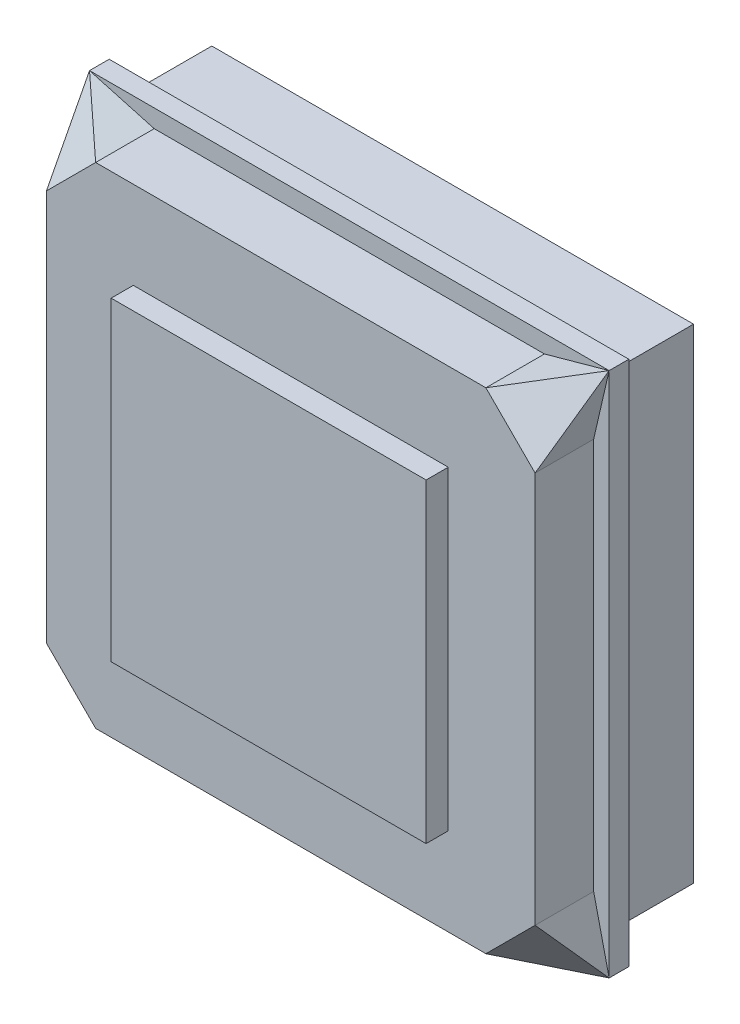
ISO-10303-21;
HEADER;
FILE_DESCRIPTION(('STEP AP214'),'2;1');
FILE_NAME('part.step','',(''),(''),'','','');
FILE_SCHEMA(('AUTOMOTIVE_DESIGN { 1 0 10303 214 1 1 1 1 }'));
ENDSEC;
DATA;
#1=APPLICATION_CONTEXT('core data for automotive mechanical design processes');
#2=APPLICATION_PROTOCOL_DEFINITION('international standard','automotive_design',2000,#1);
#3=PRODUCT_CONTEXT('',#1,'mechanical');
#4=PRODUCT('Part','Part','',(#3));
#5=PRODUCT_RELATED_PRODUCT_CATEGORY('part','',(#4));
#6=PRODUCT_DEFINITION_FORMATION('','',#4);
#7=PRODUCT_DEFINITION_CONTEXT('part definition',#1,'design');
#8=PRODUCT_DEFINITION('design','',#6,#7);
#9=PRODUCT_DEFINITION_SHAPE('','',#8);
#10=(LENGTH_UNIT() NAMED_UNIT(*) SI_UNIT(.MILLI.,.METRE.));
#11=(NAMED_UNIT(*) PLANE_ANGLE_UNIT() SI_UNIT($,.RADIAN.));
#12=(NAMED_UNIT(*) SI_UNIT($,.STERADIAN.) SOLID_ANGLE_UNIT());
#13=UNCERTAINTY_MEASURE_WITH_UNIT(LENGTH_MEASURE(1.E-05),#10,'distance_accuracy_value','');
#14=(GEOMETRIC_REPRESENTATION_CONTEXT(3) GLOBAL_UNCERTAINTY_ASSIGNED_CONTEXT((#13)) GLOBAL_UNIT_ASSIGNED_CONTEXT((#10,
#11,#12)) REPRESENTATION_CONTEXT('',''));
#15=CARTESIAN_POINT('',(0.,0.,0.));
#16=DIRECTION('',(0.,0.,1.));
#17=DIRECTION('',(1.,0.,0.));
#18=AXIS2_PLACEMENT_3D('',#15,#16,#17);
#19=CARTESIAN_POINT('',(0.,0.,4.0386));
#20=DIRECTION('',(0.,0.,-1.));
#21=DIRECTION('',(-1.,0.,0.));
#22=AXIS2_PLACEMENT_3D('',#19,#20,#21);
#23=PLANE('',#22);
#24=DIRECTION('',(0.,-1.,0.));
#25=VECTOR('',#24,1.);
#26=CARTESIAN_POINT('',(-12.6111,-10.1092,4.0386));
#27=LINE('',#26,#25);
#28=CARTESIAN_POINT('',(-12.6111,10.1092,4.0386));
#29=VERTEX_POINT('',#28);
#30=CARTESIAN_POINT('',(-12.6111,-10.1092,4.0386));
#31=VERTEX_POINT('',#30);
#32=EDGE_CURVE('E289',#29,#31,#27,.T.);
#33=ORIENTED_EDGE('',*,*,#32,.T.);
#34=DIRECTION('',(0.707106781186548,-0.707106781186548,0.));
#35=VECTOR('',#34,1.);
#36=CARTESIAN_POINT('',(-12.6111,-10.1092,4.0386));
#37=LINE('',#36,#35);
#38=CARTESIAN_POINT('',(-10.0711,-12.6492,4.0386));
#39=VERTEX_POINT('',#38);
#40=EDGE_CURVE('E291',#31,#39,#37,.T.);
#41=ORIENTED_EDGE('',*,*,#40,.T.);
#42=DIRECTION('',(1.,0.,0.));
#43=VECTOR('',#42,1.);
#44=CARTESIAN_POINT('',(-10.0711,-12.6492,4.0386));
#45=LINE('',#44,#43);
#46=CARTESIAN_POINT('',(10.0711,-12.6492,4.0386));
#47=VERTEX_POINT('',#46);
#48=EDGE_CURVE('E294',#39,#47,#45,.T.);
#49=ORIENTED_EDGE('',*,*,#48,.T.);
#50=DIRECTION('',(0.707106781186548,0.707106781186547,0.));
#51=VECTOR('',#50,1.);
#52=CARTESIAN_POINT('',(10.0711,-12.6492,4.0386));
#53=LINE('',#52,#51);
#54=CARTESIAN_POINT('',(12.6111,-10.1092,4.0386));
#55=VERTEX_POINT('',#54);
#56=EDGE_CURVE('E296',#47,#55,#53,.T.);
#57=ORIENTED_EDGE('',*,*,#56,.T.);
#58=DIRECTION('',(0.,1.,0.));
#59=VECTOR('',#58,1.);
#60=CARTESIAN_POINT('',(12.6111,-10.1092,4.0386));
#61=LINE('',#60,#59);
#62=CARTESIAN_POINT('',(12.6111,10.1092,4.0386));
#63=VERTEX_POINT('',#62);
#64=EDGE_CURVE('E298',#55,#63,#61,.T.);
#65=ORIENTED_EDGE('',*,*,#64,.T.);
#66=DIRECTION('',(-0.707106781186548,0.707106781186547,0.));
#67=VECTOR('',#66,1.);
#68=CARTESIAN_POINT('',(10.0711,12.6492,4.0386));
#69=LINE('',#68,#67);
#70=CARTESIAN_POINT('',(10.0711,12.6492,4.0386));
#71=VERTEX_POINT('',#70);
#72=EDGE_CURVE('E300',#63,#71,#69,.T.);
#73=ORIENTED_EDGE('',*,*,#72,.T.);
#74=DIRECTION('',(-1.,0.,0.));
#75=VECTOR('',#74,1.);
#76=CARTESIAN_POINT('',(-10.0711,12.6492,4.0386));
#77=LINE('',#76,#75);
#78=CARTESIAN_POINT('',(-10.0711,12.6492,4.0386));
#79=VERTEX_POINT('',#78);
#80=EDGE_CURVE('E302',#71,#79,#77,.T.);
#81=ORIENTED_EDGE('',*,*,#80,.T.);
#82=DIRECTION('',(-0.707106781186548,-0.707106781186548,0.));
#83=VECTOR('',#82,1.);
#84=CARTESIAN_POINT('',(-12.6111,10.1092,4.0386));
#85=LINE('',#84,#83);
#86=EDGE_CURVE('E304',#79,#29,#85,.T.);
#87=ORIENTED_EDGE('',*,*,#86,.T.);
#88=EDGE_LOOP('',(#33,#41,#49,#57,#65,#73,#81,#87));
#89=FACE_BOUND('',#88,.T.);
#90=DIRECTION('',(0.,1.,0.));
#91=VECTOR('',#90,1.);
#92=CARTESIAN_POINT('',(8.128,-8.128,4.0386));
#93=LINE('',#92,#91);
#94=CARTESIAN_POINT('',(8.128,-8.128,4.0386));
#95=VERTEX_POINT('',#94);
#96=CARTESIAN_POINT('',(8.128,8.128,4.0386));
#97=VERTEX_POINT('',#96);
#98=EDGE_CURVE('E207',#95,#97,#93,.T.);
#99=ORIENTED_EDGE('',*,*,#98,.F.);
#100=DIRECTION('',(1.,0.,0.));
#101=VECTOR('',#100,1.);
#102=CARTESIAN_POINT('',(-8.128,-8.128,4.0386));
#103=LINE('',#102,#101);
#104=CARTESIAN_POINT('',(-8.128,-8.128,4.0386));
#105=VERTEX_POINT('',#104);
#106=EDGE_CURVE('E204',#105,#95,#103,.T.);
#107=ORIENTED_EDGE('',*,*,#106,.F.);
#108=DIRECTION('',(0.,-1.,0.));
#109=VECTOR('',#108,1.);
#110=CARTESIAN_POINT('',(-8.128,-8.128,4.0386));
#111=LINE('',#110,#109);
#112=CARTESIAN_POINT('',(-8.128,8.128,4.0386));
#113=VERTEX_POINT('',#112);
#114=EDGE_CURVE('E70',#113,#105,#111,.T.);
#115=ORIENTED_EDGE('',*,*,#114,.F.);
#116=DIRECTION('',(-1.,0.,0.));
#117=VECTOR('',#116,1.);
#118=CARTESIAN_POINT('',(-8.128,8.128,4.0386));
#119=LINE('',#118,#117);
#120=EDGE_CURVE('E65',#97,#113,#119,.T.);
#121=ORIENTED_EDGE('',*,*,#120,.F.);
#122=EDGE_LOOP('',(#99,#107,#115,#121));
#123=FACE_BOUND('',#122,.T.);
#124=ADVANCED_FACE('F50',(#89,#123),#23,.F.);
#125=CARTESIAN_POINT('',(0.,0.,1.016));
#126=DIRECTION('',(0.,0.,-1.));
#127=DIRECTION('',(-1.,0.,0.));
#128=AXIS2_PLACEMENT_3D('',#125,#126,#127);
#129=PLANE('',#128);
#130=DIRECTION('',(0.963570380580632,-0.267454896510976,0.));
#131=VECTOR('',#130,1.);
#132=CARTESIAN_POINT('',(10.0711,-12.6492,1.016));
#133=LINE('',#132,#131);
#134=CARTESIAN_POINT('',(10.0711,-12.6492,1.016));
#135=VERTEX_POINT('',#134);
#136=CARTESIAN_POINT('',(13.4112,-13.5763,1.016));
#137=VERTEX_POINT('',#136);
#138=EDGE_CURVE('E217',#135,#137,#133,.T.);
#139=ORIENTED_EDGE('',*,*,#138,.F.);
#140=DIRECTION('',(1.,0.,0.));
#141=VECTOR('',#140,1.);
#142=CARTESIAN_POINT('',(-10.0711,-12.6492,1.016));
#143=LINE('',#142,#141);
#144=CARTESIAN_POINT('',(-10.0711,-12.6492,1.016));
#145=VERTEX_POINT('',#144);
#146=EDGE_CURVE('E309',#145,#135,#143,.T.);
#147=ORIENTED_EDGE('',*,*,#146,.F.);
#148=DIRECTION('',(0.963570380580632,0.267454896510975,0.));
#149=VECTOR('',#148,1.);
#150=CARTESIAN_POINT('',(-13.4112,-13.5763,1.016));
#151=LINE('',#150,#149);
#152=CARTESIAN_POINT('',(-13.4112,-13.5763,1.016));
#153=VERTEX_POINT('',#152);
#154=EDGE_CURVE('E220',#153,#145,#151,.T.);
#155=ORIENTED_EDGE('',*,*,#154,.F.);
#156=DIRECTION('',(1.,0.,0.));
#157=VECTOR('',#156,1.);
#158=CARTESIAN_POINT('',(-13.4112,-13.5763,1.016));
#159=LINE('',#158,#157);
#160=EDGE_CURVE('E349',#153,#137,#159,.T.);
#161=ORIENTED_EDGE('',*,*,#160,.T.);
#162=EDGE_LOOP('',(#139,#147,#155,#161));
#163=FACE_BOUND('',#162,.T.);
#164=ADVANCED_FACE('F427',(#163),#129,.F.);
#165=DIRECTION('',(0.,1.,0.));
#166=VECTOR('',#165,1.);
#167=CARTESIAN_POINT('',(12.6111,-10.1092,1.016));
#168=LINE('',#167,#166);
#169=CARTESIAN_POINT('',(12.6111,-10.1092,1.016));
#170=VERTEX_POINT('',#169);
#171=CARTESIAN_POINT('',(12.6111,10.1092,1.016));
#172=VERTEX_POINT('',#171);
#173=EDGE_CURVE('E312',#170,#172,#168,.T.);
#174=ORIENTED_EDGE('',*,*,#173,.F.);
#175=DIRECTION('',(0.224859506698758,-0.97439119569462,0.));
#176=VECTOR('',#175,1.);
#177=CARTESIAN_POINT('',(12.6111,-10.1092,1.016));
#178=LINE('',#177,#176);
#179=EDGE_CURVE('E221',#170,#137,#178,.T.);
#180=ORIENTED_EDGE('',*,*,#179,.T.);
#181=DIRECTION('',(0.,1.,0.));
#182=VECTOR('',#181,1.);
#183=CARTESIAN_POINT('',(13.4112,-13.5763,1.016));
#184=LINE('',#183,#182);
#185=CARTESIAN_POINT('',(13.4112,13.5763,1.016));
#186=VERTEX_POINT('',#185);
#187=EDGE_CURVE('E339',#137,#186,#184,.T.);
#188=ORIENTED_EDGE('',*,*,#187,.T.);
#189=DIRECTION('',(0.224859506698758,0.97439119569462,0.));
#190=VECTOR('',#189,1.);
#191=CARTESIAN_POINT('',(12.6111,10.1092,1.016));
#192=LINE('',#191,#190);
#193=EDGE_CURVE('E248',#172,#186,#192,.T.);
#194=ORIENTED_EDGE('',*,*,#193,.F.);
#195=EDGE_LOOP('',(#174,#180,#188,#194));
#196=FACE_BOUND('',#195,.T.);
#197=ADVANCED_FACE('F385',(#196),#129,.F.);
#198=DIRECTION('',(0.,-1.,0.));
#199=VECTOR('',#198,1.);
#200=CARTESIAN_POINT('',(-13.4112,-13.5763,1.016));
#201=LINE('',#200,#199);
#202=CARTESIAN_POINT('',(-13.4112,13.5763,1.016));
#203=VERTEX_POINT('',#202);
#204=EDGE_CURVE('E346',#203,#153,#201,.T.);
#205=ORIENTED_EDGE('',*,*,#204,.T.);
#206=DIRECTION('',(0.224859506698758,0.97439119569462,0.));
#207=VECTOR('',#206,1.);
#208=CARTESIAN_POINT('',(-13.4112,-13.5763,1.016));
#209=LINE('',#208,#207);
#210=CARTESIAN_POINT('',(-12.6111,-10.1092,1.016));
#211=VERTEX_POINT('',#210);
#212=EDGE_CURVE('E226',#153,#211,#209,.T.);
#213=ORIENTED_EDGE('',*,*,#212,.T.);
#214=DIRECTION('',(0.,-1.,0.));
#215=VECTOR('',#214,1.);
#216=CARTESIAN_POINT('',(-12.6111,-10.1092,1.016));
#217=LINE('',#216,#215);
#218=CARTESIAN_POINT('',(-12.6111,10.1092,1.016));
#219=VERTEX_POINT('',#218);
#220=EDGE_CURVE('E288',#219,#211,#217,.T.);
#221=ORIENTED_EDGE('',*,*,#220,.F.);
#222=DIRECTION('',(0.224859506698759,-0.97439119569462,0.));
#223=VECTOR('',#222,1.);
#224=CARTESIAN_POINT('',(-13.4112,13.5763,1.016));
#225=LINE('',#224,#223);
#226=EDGE_CURVE('E228',#203,#219,#225,.T.);
#227=ORIENTED_EDGE('',*,*,#226,.F.);
#228=EDGE_LOOP('',(#205,#213,#221,#227));
#229=FACE_BOUND('',#228,.T.);
#230=ADVANCED_FACE('F453',(#229),#129,.F.);
#231=CARTESIAN_POINT('',(0.,0.,0.));
#232=DIRECTION('',(0.,0.,-1.));
#233=DIRECTION('',(-1.,0.,0.));
#234=AXIS2_PLACEMENT_3D('',#231,#232,#233);
#235=PLANE('',#234);
#236=DIRECTION('',(0.,1.,0.));
#237=VECTOR('',#236,1.);
#238=CARTESIAN_POINT('',(13.4112,-13.5763,0.));
#239=LINE('',#238,#237);
#240=CARTESIAN_POINT('',(13.4112,-13.5763,0.));
#241=VERTEX_POINT('',#240);
#242=CARTESIAN_POINT('',(13.4112,13.5763,0.));
#243=VERTEX_POINT('',#242);
#244=EDGE_CURVE('E338',#241,#243,#239,.T.);
#245=ORIENTED_EDGE('',*,*,#244,.F.);
#246=DIRECTION('',(1.,0.,0.));
#247=VECTOR('',#246,1.);
#248=CARTESIAN_POINT('',(-13.4112,-13.5763,0.));
#249=LINE('',#248,#247);
#250=CARTESIAN_POINT('',(-13.4112,-13.5763,0.));
#251=VERTEX_POINT('',#250);
#252=EDGE_CURVE('E343',#251,#241,#249,.T.);
#253=ORIENTED_EDGE('',*,*,#252,.F.);
#254=DIRECTION('',(0.,-1.,0.));
#255=VECTOR('',#254,1.);
#256=CARTESIAN_POINT('',(-13.4112,-13.5763,0.));
#257=LINE('',#256,#255);
#258=CARTESIAN_POINT('',(-13.4112,13.5763,0.));
#259=VERTEX_POINT('',#258);
#260=EDGE_CURVE('E357',#259,#251,#257,.T.);
#261=ORIENTED_EDGE('',*,*,#260,.F.);
#262=DIRECTION('',(-1.,0.,0.));
#263=VECTOR('',#262,1.);
#264=CARTESIAN_POINT('',(-13.4112,13.5763,0.));
#265=LINE('',#264,#263);
#266=EDGE_CURVE('E355',#243,#259,#265,.T.);
#267=ORIENTED_EDGE('',*,*,#266,.F.);
#268=EDGE_LOOP('',(#245,#253,#261,#267));
#269=FACE_BOUND('',#268,.T.);
#270=DIRECTION('',(1.,0.,0.));
#271=VECTOR('',#270,1.);
#272=CARTESIAN_POINT('',(12.4333,12.4968,0.));
#273=LINE('',#272,#271);
#274=CARTESIAN_POINT('',(-12.4333,12.4968,0.));
#275=VERTEX_POINT('',#274);
#276=CARTESIAN_POINT('',(12.4333,12.4968,0.));
#277=VERTEX_POINT('',#276);
#278=EDGE_CURVE('E273',#275,#277,#273,.T.);
#279=ORIENTED_EDGE('',*,*,#278,.F.);
#280=DIRECTION('',(0.,1.,0.));
#281=VECTOR('',#280,1.);
#282=CARTESIAN_POINT('',(-12.4333,-12.4968,0.));
#283=LINE('',#282,#281);
#284=CARTESIAN_POINT('',(-12.4333,-12.4968,0.));
#285=VERTEX_POINT('',#284);
#286=EDGE_CURVE('E251',#285,#275,#283,.T.);
#287=ORIENTED_EDGE('',*,*,#286,.F.);
#288=DIRECTION('',(-1.,0.,0.));
#289=VECTOR('',#288,1.);
#290=CARTESIAN_POINT('',(12.4333,-12.4968,0.));
#291=LINE('',#290,#289);
#292=CARTESIAN_POINT('',(12.4333,-12.4968,0.));
#293=VERTEX_POINT('',#292);
#294=EDGE_CURVE('E264',#293,#285,#291,.T.);
#295=ORIENTED_EDGE('',*,*,#294,.F.);
#296=DIRECTION('',(0.,-1.,0.));
#297=VECTOR('',#296,1.);
#298=CARTESIAN_POINT('',(12.4333,-12.4968,0.));
#299=LINE('',#298,#297);
#300=EDGE_CURVE('E275',#277,#293,#299,.T.);
#301=ORIENTED_EDGE('',*,*,#300,.F.);
#302=EDGE_LOOP('',(#279,#287,#295,#301));
#303=FACE_BOUND('',#302,.T.);
#304=ADVANCED_FACE('F377',(#269,#303),#235,.T.);
#305=DIRECTION('',(-1.,0.,0.));
#306=VECTOR('',#305,1.);
#307=CARTESIAN_POINT('',(-13.4112,13.5763,1.016));
#308=LINE('',#307,#306);
#309=EDGE_CURVE('E342',#186,#203,#308,.T.);
#310=ORIENTED_EDGE('',*,*,#309,.T.);
#311=DIRECTION('',(0.963570380580632,-0.267454896510973,0.));
#312=VECTOR('',#311,1.);
#313=CARTESIAN_POINT('',(-13.4112,13.5763,1.016));
#314=LINE('',#313,#312);
#315=CARTESIAN_POINT('',(-10.0711,12.6492,1.016));
#316=VERTEX_POINT('',#315);
#317=EDGE_CURVE('E237',#203,#316,#314,.T.);
#318=ORIENTED_EDGE('',*,*,#317,.T.);
#319=DIRECTION('',(-1.,0.,0.));
#320=VECTOR('',#319,1.);
#321=CARTESIAN_POINT('',(-10.0711,12.6492,1.016));
#322=LINE('',#321,#320);
#323=CARTESIAN_POINT('',(10.0711,12.6492,1.016));
#324=VERTEX_POINT('',#323);
#325=EDGE_CURVE('E292',#324,#316,#322,.T.);
#326=ORIENTED_EDGE('',*,*,#325,.F.);
#327=DIRECTION('',(0.963570380580633,0.267454896510973,0.));
#328=VECTOR('',#327,1.);
#329=CARTESIAN_POINT('',(10.0711,12.6492,1.016));
#330=LINE('',#329,#328);
#331=EDGE_CURVE('E252',#324,#186,#330,.T.);
#332=ORIENTED_EDGE('',*,*,#331,.T.);
#333=EDGE_LOOP('',(#310,#318,#326,#332));
#334=FACE_BOUND('',#333,.T.);
#335=ADVANCED_FACE('F390',(#334),#129,.F.);
#336=CARTESIAN_POINT('',(13.4112,-13.5763,1.016));
#337=DIRECTION('',(-1.,0.,0.));
#338=DIRECTION('',(0.,0.,1.));
#339=AXIS2_PLACEMENT_3D('',#336,#337,#338);
#340=PLANE('',#339);
#341=ORIENTED_EDGE('',*,*,#244,.T.);
#342=DIRECTION('',(0.,0.,-1.));
#343=VECTOR('',#342,1.);
#344=CARTESIAN_POINT('',(13.4112,13.5763,1.016));
#345=LINE('',#344,#343);
#346=EDGE_CURVE('E12',#186,#243,#345,.T.);
#347=ORIENTED_EDGE('',*,*,#346,.F.);
#348=ORIENTED_EDGE('',*,*,#187,.F.);
#349=DIRECTION('',(0.,0.,-1.));
#350=VECTOR('',#349,1.);
#351=CARTESIAN_POINT('',(13.4112,-13.5763,1.016));
#352=LINE('',#351,#350);
#353=EDGE_CURVE('E352',#137,#241,#352,.T.);
#354=ORIENTED_EDGE('',*,*,#353,.T.);
#355=EDGE_LOOP('',(#341,#347,#348,#354));
#356=FACE_BOUND('',#355,.T.);
#357=ADVANCED_FACE('F52',(#356),#340,.F.);
#358=CARTESIAN_POINT('',(-13.4112,13.5763,1.016));
#359=DIRECTION('',(0.,-1.,0.));
#360=DIRECTION('',(0.,0.,-1.));
#361=AXIS2_PLACEMENT_3D('',#358,#359,#360);
#362=PLANE('',#361);
#363=ORIENTED_EDGE('',*,*,#266,.T.);
#364=DIRECTION('',(0.,0.,-1.));
#365=VECTOR('',#364,1.);
#366=CARTESIAN_POINT('',(-13.4112,13.5763,1.016));
#367=LINE('',#366,#365);
#368=EDGE_CURVE('E58',#203,#259,#367,.T.);
#369=ORIENTED_EDGE('',*,*,#368,.F.);
#370=ORIENTED_EDGE('',*,*,#309,.F.);
#371=ORIENTED_EDGE('',*,*,#346,.T.);
#372=EDGE_LOOP('',(#363,#369,#370,#371));
#373=FACE_BOUND('',#372,.T.);
#374=ADVANCED_FACE('F387',(#373),#362,.F.);
#375=CARTESIAN_POINT('',(-13.4112,-13.5763,1.016));
#376=DIRECTION('',(1.,0.,0.));
#377=DIRECTION('',(0.,0.,-1.));
#378=AXIS2_PLACEMENT_3D('',#375,#376,#377);
#379=PLANE('',#378);
#380=ORIENTED_EDGE('',*,*,#260,.T.);
#381=DIRECTION('',(0.,0.,-1.));
#382=VECTOR('',#381,1.);
#383=CARTESIAN_POINT('',(-13.4112,-13.5763,1.016));
#384=LINE('',#383,#382);
#385=EDGE_CURVE('E362',#153,#251,#384,.T.);
#386=ORIENTED_EDGE('',*,*,#385,.F.);
#387=ORIENTED_EDGE('',*,*,#204,.F.);
#388=ORIENTED_EDGE('',*,*,#368,.T.);
#389=EDGE_LOOP('',(#380,#386,#387,#388));
#390=FACE_BOUND('',#389,.T.);
#391=ADVANCED_FACE('F369',(#390),#379,.F.);
#392=CARTESIAN_POINT('',(-13.4112,-13.5763,1.016));
#393=DIRECTION('',(0.,1.,0.));
#394=DIRECTION('',(0.,0.,1.));
#395=AXIS2_PLACEMENT_3D('',#392,#393,#394);
#396=PLANE('',#395);
#397=ORIENTED_EDGE('',*,*,#252,.T.);
#398=ORIENTED_EDGE('',*,*,#353,.F.);
#399=ORIENTED_EDGE('',*,*,#160,.F.);
#400=ORIENTED_EDGE('',*,*,#385,.T.);
#401=EDGE_LOOP('',(#397,#398,#399,#400));
#402=FACE_BOUND('',#401,.T.);
#403=ADVANCED_FACE('F381',(#402),#396,.F.);
#404=CARTESIAN_POINT('',(-12.6111,-10.1092,4.0386));
#405=DIRECTION('',(1.,0.,0.));
#406=DIRECTION('',(0.,0.,-1.));
#407=AXIS2_PLACEMENT_3D('',#404,#405,#406);
#408=PLANE('',#407);
#409=ORIENTED_EDGE('',*,*,#220,.T.);
#410=DIRECTION('',(0.,0.,-1.));
#411=VECTOR('',#410,1.);
#412=CARTESIAN_POINT('',(-12.6111,-10.1092,4.0386));
#413=LINE('',#412,#411);
#414=EDGE_CURVE('E335',#31,#211,#413,.T.);
#415=ORIENTED_EDGE('',*,*,#414,.F.);
#416=ORIENTED_EDGE('',*,*,#32,.F.);
#417=DIRECTION('',(0.,0.,-1.));
#418=VECTOR('',#417,1.);
#419=CARTESIAN_POINT('',(-12.6111,10.1092,4.0386));
#420=LINE('',#419,#418);
#421=EDGE_CURVE('E306',#29,#219,#420,.T.);
#422=ORIENTED_EDGE('',*,*,#421,.T.);
#423=EDGE_LOOP('',(#409,#415,#416,#422));
#424=FACE_BOUND('',#423,.T.);
#425=ADVANCED_FACE('F447',(#424),#408,.F.);
#426=CARTESIAN_POINT('',(-10.0711,-12.6492,4.0386));
#427=DIRECTION('',(0.,1.,0.));
#428=DIRECTION('',(0.,0.,1.));
#429=AXIS2_PLACEMENT_3D('',#426,#427,#428);
#430=PLANE('',#429);
#431=ORIENTED_EDGE('',*,*,#146,.T.);
#432=DIRECTION('',(0.,0.,-1.));
#433=VECTOR('',#432,1.);
#434=CARTESIAN_POINT('',(10.0711,-12.6492,4.0386));
#435=LINE('',#434,#433);
#436=EDGE_CURVE('E330',#47,#135,#435,.T.);
#437=ORIENTED_EDGE('',*,*,#436,.F.);
#438=ORIENTED_EDGE('',*,*,#48,.F.);
#439=DIRECTION('',(0.,0.,-1.));
#440=VECTOR('',#439,1.);
#441=CARTESIAN_POINT('',(-10.0711,-12.6492,4.0386));
#442=LINE('',#441,#440);
#443=EDGE_CURVE('E333',#39,#145,#442,.T.);
#444=ORIENTED_EDGE('',*,*,#443,.T.);
#445=EDGE_LOOP('',(#431,#437,#438,#444));
#446=FACE_BOUND('',#445,.T.);
#447=ADVANCED_FACE('F443',(#446),#430,.F.);
#448=CARTESIAN_POINT('',(12.6111,-10.1092,4.0386));
#449=DIRECTION('',(-1.,0.,0.));
#450=DIRECTION('',(0.,0.,1.));
#451=AXIS2_PLACEMENT_3D('',#448,#449,#450);
#452=PLANE('',#451);
#453=ORIENTED_EDGE('',*,*,#173,.T.);
#454=DIRECTION('',(0.,0.,-1.));
#455=VECTOR('',#454,1.);
#456=CARTESIAN_POINT('',(12.6111,10.1092,4.0386));
#457=LINE('',#456,#455);
#458=EDGE_CURVE('E324',#63,#172,#457,.T.);
#459=ORIENTED_EDGE('',*,*,#458,.F.);
#460=ORIENTED_EDGE('',*,*,#64,.F.);
#461=DIRECTION('',(0.,0.,-1.));
#462=VECTOR('',#461,1.);
#463=CARTESIAN_POINT('',(12.6111,-10.1092,4.0386));
#464=LINE('',#463,#462);
#465=EDGE_CURVE('E327',#55,#170,#464,.T.);
#466=ORIENTED_EDGE('',*,*,#465,.T.);
#467=EDGE_LOOP('',(#453,#459,#460,#466));
#468=FACE_BOUND('',#467,.T.);
#469=ADVANCED_FACE('F440',(#468),#452,.F.);
#470=CARTESIAN_POINT('',(-10.0711,12.6492,4.0386));
#471=DIRECTION('',(0.,-1.,0.));
#472=DIRECTION('',(0.,0.,-1.));
#473=AXIS2_PLACEMENT_3D('',#470,#471,#472);
#474=PLANE('',#473);
#475=ORIENTED_EDGE('',*,*,#325,.T.);
#476=DIRECTION('',(0.,0.,-1.));
#477=VECTOR('',#476,1.);
#478=CARTESIAN_POINT('',(-10.0711,12.6492,4.0386));
#479=LINE('',#478,#477);
#480=EDGE_CURVE('E318',#79,#316,#479,.T.);
#481=ORIENTED_EDGE('',*,*,#480,.F.);
#482=ORIENTED_EDGE('',*,*,#80,.F.);
#483=DIRECTION('',(0.,0.,-1.));
#484=VECTOR('',#483,1.);
#485=CARTESIAN_POINT('',(10.0711,12.6492,4.0386));
#486=LINE('',#485,#484);
#487=EDGE_CURVE('E321',#71,#324,#486,.T.);
#488=ORIENTED_EDGE('',*,*,#487,.T.);
#489=EDGE_LOOP('',(#475,#481,#482,#488));
#490=FACE_BOUND('',#489,.T.);
#491=ADVANCED_FACE('F407',(#490),#474,.F.);
#492=CARTESIAN_POINT('',(-12.4333,-12.4968,-4.318));
#493=DIRECTION('',(1.,0.,0.));
#494=DIRECTION('',(0.,0.,-1.));
#495=AXIS2_PLACEMENT_3D('',#492,#493,#494);
#496=PLANE('',#495);
#497=ORIENTED_EDGE('',*,*,#286,.T.);
#498=DIRECTION('',(0.,0.,1.));
#499=VECTOR('',#498,1.);
#500=CARTESIAN_POINT('',(-12.4333,12.4968,-4.318));
#501=LINE('',#500,#499);
#502=CARTESIAN_POINT('',(-12.4333,12.4968,-4.318));
#503=VERTEX_POINT('',#502);
#504=EDGE_CURVE('E286',#503,#275,#501,.T.);
#505=ORIENTED_EDGE('',*,*,#504,.F.);
#506=DIRECTION('',(0.,1.,0.));
#507=VECTOR('',#506,1.);
#508=CARTESIAN_POINT('',(-12.4333,-12.4968,-4.318));
#509=LINE('',#508,#507);
#510=CARTESIAN_POINT('',(-12.4333,-12.4968,-4.318));
#511=VERTEX_POINT('',#510);
#512=EDGE_CURVE('E260',#511,#503,#509,.T.);
#513=ORIENTED_EDGE('',*,*,#512,.F.);
#514=DIRECTION('',(0.,0.,1.));
#515=VECTOR('',#514,1.);
#516=CARTESIAN_POINT('',(-12.4333,-12.4968,-4.318));
#517=LINE('',#516,#515);
#518=EDGE_CURVE('E270',#511,#285,#517,.T.);
#519=ORIENTED_EDGE('',*,*,#518,.T.);
#520=EDGE_LOOP('',(#497,#505,#513,#519));
#521=FACE_BOUND('',#520,.T.);
#522=ADVANCED_FACE('F436',(#521),#496,.F.);
#523=CARTESIAN_POINT('',(12.4333,12.4968,-4.318));
#524=DIRECTION('',(0.,-1.,0.));
#525=DIRECTION('',(0.,0.,-1.));
#526=AXIS2_PLACEMENT_3D('',#523,#524,#525);
#527=PLANE('',#526);
#528=ORIENTED_EDGE('',*,*,#278,.T.);
#529=DIRECTION('',(0.,0.,1.));
#530=VECTOR('',#529,1.);
#531=CARTESIAN_POINT('',(12.4333,12.4968,-4.318));
#532=LINE('',#531,#530);
#533=CARTESIAN_POINT('',(12.4333,12.4968,-4.318));
#534=VERTEX_POINT('',#533);
#535=EDGE_CURVE('E283',#534,#277,#532,.T.);
#536=ORIENTED_EDGE('',*,*,#535,.F.);
#537=DIRECTION('',(1.,0.,0.));
#538=VECTOR('',#537,1.);
#539=CARTESIAN_POINT('',(12.4333,12.4968,-4.318));
#540=LINE('',#539,#538);
#541=EDGE_CURVE('E263',#503,#534,#540,.T.);
#542=ORIENTED_EDGE('',*,*,#541,.F.);
#543=ORIENTED_EDGE('',*,*,#504,.T.);
#544=EDGE_LOOP('',(#528,#536,#542,#543));
#545=FACE_BOUND('',#544,.T.);
#546=ADVANCED_FACE('F597',(#545),#527,.F.);
#547=CARTESIAN_POINT('',(12.4333,-12.4968,-4.318));
#548=DIRECTION('',(-1.,0.,0.));
#549=DIRECTION('',(0.,0.,1.));
#550=AXIS2_PLACEMENT_3D('',#547,#548,#549);
#551=PLANE('',#550);
#552=ORIENTED_EDGE('',*,*,#300,.T.);
#553=DIRECTION('',(0.,0.,1.));
#554=VECTOR('',#553,1.);
#555=CARTESIAN_POINT('',(12.4333,-12.4968,-4.318));
#556=LINE('',#555,#554);
#557=CARTESIAN_POINT('',(12.4333,-12.4968,-4.318));
#558=VERTEX_POINT('',#557);
#559=EDGE_CURVE('E281',#558,#293,#556,.T.);
#560=ORIENTED_EDGE('',*,*,#559,.F.);
#561=DIRECTION('',(0.,-1.,0.));
#562=VECTOR('',#561,1.);
#563=CARTESIAN_POINT('',(12.4333,-12.4968,-4.318));
#564=LINE('',#563,#562);
#565=EDGE_CURVE('E266',#534,#558,#564,.T.);
#566=ORIENTED_EDGE('',*,*,#565,.F.);
#567=ORIENTED_EDGE('',*,*,#535,.T.);
#568=EDGE_LOOP('',(#552,#560,#566,#567));
#569=FACE_BOUND('',#568,.T.);
#570=ADVANCED_FACE('F594',(#569),#551,.F.);
#571=CARTESIAN_POINT('',(12.4333,-12.4968,-4.318));
#572=DIRECTION('',(0.,1.,0.));
#573=DIRECTION('',(0.,0.,1.));
#574=AXIS2_PLACEMENT_3D('',#571,#572,#573);
#575=PLANE('',#574);
#576=ORIENTED_EDGE('',*,*,#294,.T.);
#577=ORIENTED_EDGE('',*,*,#518,.F.);
#578=DIRECTION('',(-1.,0.,0.));
#579=VECTOR('',#578,1.);
#580=CARTESIAN_POINT('',(12.4333,-12.4968,-4.318));
#581=LINE('',#580,#579);
#582=EDGE_CURVE('E268',#558,#511,#581,.T.);
#583=ORIENTED_EDGE('',*,*,#582,.F.);
#584=ORIENTED_EDGE('',*,*,#559,.T.);
#585=EDGE_LOOP('',(#576,#577,#583,#584));
#586=FACE_BOUND('',#585,.T.);
#587=ADVANCED_FACE('F590',(#586),#575,.F.);
#588=CARTESIAN_POINT('',(0.,0.,-4.318));
#589=DIRECTION('',(0.,0.,1.));
#590=DIRECTION('',(1.,0.,0.));
#591=AXIS2_PLACEMENT_3D('',#588,#589,#590);
#592=PLANE('',#591);
#593=ORIENTED_EDGE('',*,*,#512,.T.);
#594=ORIENTED_EDGE('',*,*,#541,.T.);
#595=ORIENTED_EDGE('',*,*,#565,.T.);
#596=ORIENTED_EDGE('',*,*,#582,.T.);
#597=EDGE_LOOP('',(#593,#594,#595,#596));
#598=FACE_BOUND('',#597,.T.);
#599=ADVANCED_FACE('F585',(#598),#592,.F.);
#600=CARTESIAN_POINT('',(9.75852303370786,-2.25196685393258,0.));
#601=DIRECTION('',(-0.97439119569462,0.224859506698758,0.));
#602=DIRECTION('',(-0.224859506698758,-0.97439119569462,0.));
#603=AXIS2_PLACEMENT_3D('',#600,#601,#602);
#604=PLANE('',#603);
#605=ORIENTED_EDGE('',*,*,#193,.T.);
#606=DIRECTION('',(0.171374175561288,0.742621427432247,-0.647413552120421));
#607=VECTOR('',#606,1.);
#608=CARTESIAN_POINT('',(12.6111,10.1092,4.0386));
#609=LINE('',#608,#607);
#610=EDGE_CURVE('E239',#63,#186,#609,.T.);
#611=ORIENTED_EDGE('',*,*,#610,.F.);
#612=ORIENTED_EDGE('',*,*,#458,.T.);
#613=EDGE_LOOP('',(#605,#611,#612));
#614=FACE_BOUND('',#613,.T.);
#615=ADVANCED_FACE('F395',(#614),#604,.F.);
#616=CARTESIAN_POINT('',(-2.53943862788262,9.14893642648127,0.));
#617=DIRECTION('',(-0.267454896510973,0.963570380580632,0.));
#618=DIRECTION('',(-0.963570380580632,-0.267454896510973,0.));
#619=AXIS2_PLACEMENT_3D('',#616,#617,#618);
#620=PLANE('',#619);
#621=DIRECTION('',(0.726247829027504,0.201582097030447,-0.657212864291049));
#622=VECTOR('',#621,1.);
#623=CARTESIAN_POINT('',(10.0711,12.6492,4.0386));
#624=LINE('',#623,#622);
#625=EDGE_CURVE('E255',#71,#186,#624,.T.);
#626=ORIENTED_EDGE('',*,*,#625,.T.);
#627=ORIENTED_EDGE('',*,*,#331,.F.);
#628=ORIENTED_EDGE('',*,*,#487,.F.);
#629=EDGE_LOOP('',(#626,#627,#628));
#630=FACE_BOUND('',#629,.T.);
#631=ADVANCED_FACE('F398',(#630),#620,.T.);
#632=CARTESIAN_POINT('',(7.11777772963605,7.11777772963606,10.0486273830156));
#633=DIRECTION('',(0.500433087998044,0.500433087998045,0.706493771291356));
#634=DIRECTION('',(0.,-0.816024481101655,0.57801734078034));
#635=AXIS2_PLACEMENT_3D('',#632,#633,#634);
#636=PLANE('',#635);
#637=ORIENTED_EDGE('',*,*,#610,.T.);
#638=ORIENTED_EDGE('',*,*,#625,.F.);
#639=ORIENTED_EDGE('',*,*,#72,.F.);
#640=EDGE_LOOP('',(#637,#638,#639));
#641=FACE_BOUND('',#640,.T.);
#642=ADVANCED_FACE('F401',(#641),#636,.T.);
#643=CARTESIAN_POINT('',(2.53943862788262,9.14893642648127,0.));
#644=DIRECTION('',(0.267454896510973,0.963570380580632,0.));
#645=DIRECTION('',(-0.963570380580632,0.267454896510973,0.));
#646=AXIS2_PLACEMENT_3D('',#643,#644,#645);
#647=PLANE('',#646);
#648=DIRECTION('',(0.726247829027504,-0.201582097030447,0.657212864291049));
#649=VECTOR('',#648,1.);
#650=CARTESIAN_POINT('',(-13.4112,13.5763,1.016));
#651=LINE('',#650,#649);
#652=EDGE_CURVE('E240',#203,#79,#651,.T.);
#653=ORIENTED_EDGE('',*,*,#652,.T.);
#654=ORIENTED_EDGE('',*,*,#480,.T.);
#655=ORIENTED_EDGE('',*,*,#317,.F.);
#656=EDGE_LOOP('',(#653,#654,#655));
#657=FACE_BOUND('',#656,.T.);
#658=ADVANCED_FACE('F415',(#657),#647,.T.);
#659=CARTESIAN_POINT('',(-7.11777772963605,7.11777772963605,10.0486273830156));
#660=DIRECTION('',(0.500433087998044,-0.500433087998044,-0.706493771291356));
#661=DIRECTION('',(-0.816024481101655,0.,-0.57801734078034));
#662=AXIS2_PLACEMENT_3D('',#659,#660,#661);
#663=PLANE('',#662);
#664=DIRECTION('',(0.171374175561288,-0.742621427432247,0.647413552120421));
#665=VECTOR('',#664,1.);
#666=CARTESIAN_POINT('',(-13.4112,13.5763,1.016));
#667=LINE('',#666,#665);
#668=EDGE_CURVE('E243',#203,#29,#667,.T.);
#669=ORIENTED_EDGE('',*,*,#668,.T.);
#670=ORIENTED_EDGE('',*,*,#86,.F.);
#671=ORIENTED_EDGE('',*,*,#652,.F.);
#672=EDGE_LOOP('',(#669,#670,#671));
#673=FACE_BOUND('',#672,.T.);
#674=ADVANCED_FACE('F413',(#673),#663,.F.);
#675=CARTESIAN_POINT('',(-9.75852303370787,-2.25196685393259,0.));
#676=DIRECTION('',(0.97439119569462,0.224859506698759,0.));
#677=DIRECTION('',(-0.224859506698759,0.97439119569462,0.));
#678=AXIS2_PLACEMENT_3D('',#675,#676,#677);
#679=PLANE('',#678);
#680=ORIENTED_EDGE('',*,*,#226,.T.);
#681=ORIENTED_EDGE('',*,*,#421,.F.);
#682=ORIENTED_EDGE('',*,*,#668,.F.);
#683=EDGE_LOOP('',(#680,#681,#682));
#684=FACE_BOUND('',#683,.T.);
#685=ADVANCED_FACE('F422',(#684),#679,.F.);
#686=CARTESIAN_POINT('',(-9.75852303370788,2.25196685393258,0.));
#687=DIRECTION('',(-0.97439119569462,0.224859506698758,0.));
#688=DIRECTION('',(-0.224859506698758,-0.97439119569462,0.));
#689=AXIS2_PLACEMENT_3D('',#686,#687,#688);
#690=PLANE('',#689);
#691=DIRECTION('',(0.171374175561288,0.742621427432248,0.64741355212042));
#692=VECTOR('',#691,1.);
#693=CARTESIAN_POINT('',(-13.4112,-13.5763,1.016));
#694=LINE('',#693,#692);
#695=EDGE_CURVE('E229',#153,#31,#694,.T.);
#696=ORIENTED_EDGE('',*,*,#695,.T.);
#697=ORIENTED_EDGE('',*,*,#414,.T.);
#698=ORIENTED_EDGE('',*,*,#212,.F.);
#699=EDGE_LOOP('',(#696,#697,#698));
#700=FACE_BOUND('',#699,.T.);
#701=ADVANCED_FACE('F515',(#700),#690,.T.);
#702=CARTESIAN_POINT('',(-7.11777772963604,-7.11777772963604,10.0486273830156));
#703=DIRECTION('',(0.500433087998044,0.500433087998044,-0.706493771291357));
#704=DIRECTION('',(-0.816024481101655,0.,-0.578017340780339));
#705=AXIS2_PLACEMENT_3D('',#702,#703,#704);
#706=PLANE('',#705);
#707=DIRECTION('',(0.726247829027504,0.201582097030449,0.657212864291049));
#708=VECTOR('',#707,1.);
#709=CARTESIAN_POINT('',(-13.4112,-13.5763,1.016));
#710=LINE('',#709,#708);
#711=EDGE_CURVE('E232',#153,#39,#710,.T.);
#712=ORIENTED_EDGE('',*,*,#711,.T.);
#713=ORIENTED_EDGE('',*,*,#40,.F.);
#714=ORIENTED_EDGE('',*,*,#695,.F.);
#715=EDGE_LOOP('',(#712,#713,#714));
#716=FACE_BOUND('',#715,.T.);
#717=ADVANCED_FACE('F505',(#716),#706,.F.);
#718=CARTESIAN_POINT('',(2.53943862788264,-9.14893642648122,0.));
#719=DIRECTION('',(-0.267454896510975,0.963570380580632,0.));
#720=DIRECTION('',(-0.963570380580632,-0.267454896510975,0.));
#721=AXIS2_PLACEMENT_3D('',#718,#719,#720);
#722=PLANE('',#721);
#723=ORIENTED_EDGE('',*,*,#154,.T.);
#724=ORIENTED_EDGE('',*,*,#443,.F.);
#725=ORIENTED_EDGE('',*,*,#711,.F.);
#726=EDGE_LOOP('',(#723,#724,#725));
#727=FACE_BOUND('',#726,.T.);
#728=ADVANCED_FACE('F500',(#727),#722,.F.);
#729=CARTESIAN_POINT('',(-2.53943862788264,-9.14893642648122,0.));
#730=DIRECTION('',(0.267454896510976,0.963570380580632,0.));
#731=DIRECTION('',(-0.963570380580632,0.267454896510976,0.));
#732=AXIS2_PLACEMENT_3D('',#729,#730,#731);
#733=PLANE('',#732);
#734=ORIENTED_EDGE('',*,*,#138,.T.);
#735=DIRECTION('',(0.726247829027504,-0.201582097030449,-0.657212864291049));
#736=VECTOR('',#735,1.);
#737=CARTESIAN_POINT('',(10.0711,-12.6492,4.0386));
#738=LINE('',#737,#736);
#739=EDGE_CURVE('E208',#47,#137,#738,.T.);
#740=ORIENTED_EDGE('',*,*,#739,.F.);
#741=ORIENTED_EDGE('',*,*,#436,.T.);
#742=EDGE_LOOP('',(#734,#740,#741));
#743=FACE_BOUND('',#742,.T.);
#744=ADVANCED_FACE('F504',(#743),#733,.F.);
#745=CARTESIAN_POINT('',(9.75852303370787,2.25196685393258,0.));
#746=DIRECTION('',(0.97439119569462,0.224859506698758,0.));
#747=DIRECTION('',(-0.224859506698758,0.97439119569462,0.));
#748=AXIS2_PLACEMENT_3D('',#745,#746,#747);
#749=PLANE('',#748);
#750=DIRECTION('',(0.171374175561287,-0.742621427432248,-0.64741355212042));
#751=VECTOR('',#750,1.);
#752=CARTESIAN_POINT('',(12.6111,-10.1092,4.0386));
#753=LINE('',#752,#751);
#754=EDGE_CURVE('E211',#55,#137,#753,.T.);
#755=ORIENTED_EDGE('',*,*,#754,.T.);
#756=ORIENTED_EDGE('',*,*,#179,.F.);
#757=ORIENTED_EDGE('',*,*,#465,.F.);
#758=EDGE_LOOP('',(#755,#756,#757));
#759=FACE_BOUND('',#758,.T.);
#760=ADVANCED_FACE('F684',(#759),#749,.T.);
#761=CARTESIAN_POINT('',(7.11777772963604,-7.11777772963604,10.0486273830156));
#762=DIRECTION('',(0.500433087998044,-0.500433087998044,0.706493771291357));
#763=DIRECTION('',(0.,-0.816024481101655,-0.578017340780339));
#764=AXIS2_PLACEMENT_3D('',#761,#762,#763);
#765=PLANE('',#764);
#766=ORIENTED_EDGE('',*,*,#739,.T.);
#767=ORIENTED_EDGE('',*,*,#754,.F.);
#768=ORIENTED_EDGE('',*,*,#56,.F.);
#769=EDGE_LOOP('',(#766,#767,#768));
#770=FACE_BOUND('',#769,.T.);
#771=ADVANCED_FACE('F681',(#770),#765,.T.);
#772=CARTESIAN_POINT('',(8.128,-8.128,5.1816));
#773=DIRECTION('',(-1.,0.,0.));
#774=DIRECTION('',(0.,0.,1.));
#775=AXIS2_PLACEMENT_3D('',#772,#773,#774);
#776=PLANE('',#775);
#777=ORIENTED_EDGE('',*,*,#98,.T.);
#778=DIRECTION('',(0.,0.,-1.));
#779=VECTOR('',#778,1.);
#780=CARTESIAN_POINT('',(8.128,8.128,5.1816));
#781=LINE('',#780,#779);
#782=CARTESIAN_POINT('',(8.128,8.128,5.1816));
#783=VERTEX_POINT('',#782);
#784=EDGE_CURVE('E188',#783,#97,#781,.T.);
#785=ORIENTED_EDGE('',*,*,#784,.F.);
#786=DIRECTION('',(0.,1.,0.));
#787=VECTOR('',#786,1.);
#788=CARTESIAN_POINT('',(8.128,-8.128,5.1816));
#789=LINE('',#788,#787);
#790=CARTESIAN_POINT('',(8.128,-8.128,5.1816));
#791=VERTEX_POINT('',#790);
#792=EDGE_CURVE('E195',#791,#783,#789,.T.);
#793=ORIENTED_EDGE('',*,*,#792,.F.);
#794=DIRECTION('',(0.,0.,-1.));
#795=VECTOR('',#794,1.);
#796=CARTESIAN_POINT('',(8.128,-8.128,5.1816));
#797=LINE('',#796,#795);
#798=EDGE_CURVE('E767',#791,#95,#797,.T.);
#799=ORIENTED_EDGE('',*,*,#798,.T.);
#800=EDGE_LOOP('',(#777,#785,#793,#799));
#801=FACE_BOUND('',#800,.T.);
#802=ADVANCED_FACE('F206',(#801),#776,.F.);
#803=CARTESIAN_POINT('',(-8.128,8.128,5.1816));
#804=DIRECTION('',(0.,-1.,0.));
#805=DIRECTION('',(0.,0.,-1.));
#806=AXIS2_PLACEMENT_3D('',#803,#804,#805);
#807=PLANE('',#806);
#808=ORIENTED_EDGE('',*,*,#120,.T.);
#809=DIRECTION('',(0.,0.,-1.));
#810=VECTOR('',#809,1.);
#811=CARTESIAN_POINT('',(-8.128,8.128,5.1816));
#812=LINE('',#811,#810);
#813=CARTESIAN_POINT('',(-8.128,8.128,5.1816));
#814=VERTEX_POINT('',#813);
#815=EDGE_CURVE('E191',#814,#113,#812,.T.);
#816=ORIENTED_EDGE('',*,*,#815,.F.);
#817=DIRECTION('',(-1.,0.,0.));
#818=VECTOR('',#817,1.);
#819=CARTESIAN_POINT('',(-8.128,8.128,5.1816));
#820=LINE('',#819,#818);
#821=EDGE_CURVE('E184',#783,#814,#820,.T.);
#822=ORIENTED_EDGE('',*,*,#821,.F.);
#823=ORIENTED_EDGE('',*,*,#784,.T.);
#824=EDGE_LOOP('',(#808,#816,#822,#823));
#825=FACE_BOUND('',#824,.T.);
#826=ADVANCED_FACE('F186',(#825),#807,.F.);
#827=CARTESIAN_POINT('',(-8.128,-8.128,5.1816));
#828=DIRECTION('',(1.,0.,0.));
#829=DIRECTION('',(0.,0.,-1.));
#830=AXIS2_PLACEMENT_3D('',#827,#828,#829);
#831=PLANE('',#830);
#832=ORIENTED_EDGE('',*,*,#114,.T.);
#833=DIRECTION('',(0.,0.,-1.));
#834=VECTOR('',#833,1.);
#835=CARTESIAN_POINT('',(-8.128,-8.128,5.1816));
#836=LINE('',#835,#834);
#837=CARTESIAN_POINT('',(-8.128,-8.128,5.1816));
#838=VERTEX_POINT('',#837);
#839=EDGE_CURVE('E213',#838,#105,#836,.T.);
#840=ORIENTED_EDGE('',*,*,#839,.F.);
#841=DIRECTION('',(0.,-1.,0.));
#842=VECTOR('',#841,1.);
#843=CARTESIAN_POINT('',(-8.128,-8.128,5.1816));
#844=LINE('',#843,#842);
#845=EDGE_CURVE('E194',#814,#838,#844,.T.);
#846=ORIENTED_EDGE('',*,*,#845,.F.);
#847=ORIENTED_EDGE('',*,*,#815,.T.);
#848=EDGE_LOOP('',(#832,#840,#846,#847));
#849=FACE_BOUND('',#848,.T.);
#850=ADVANCED_FACE('F697',(#849),#831,.F.);
#851=CARTESIAN_POINT('',(-8.128,-8.128,5.1816));
#852=DIRECTION('',(0.,1.,0.));
#853=DIRECTION('',(0.,0.,1.));
#854=AXIS2_PLACEMENT_3D('',#851,#852,#853);
#855=PLANE('',#854);
#856=ORIENTED_EDGE('',*,*,#106,.T.);
#857=ORIENTED_EDGE('',*,*,#798,.F.);
#858=DIRECTION('',(1.,0.,0.));
#859=VECTOR('',#858,1.);
#860=CARTESIAN_POINT('',(-8.128,-8.128,5.1816));
#861=LINE('',#860,#859);
#862=EDGE_CURVE('E200',#838,#791,#861,.T.);
#863=ORIENTED_EDGE('',*,*,#862,.F.);
#864=ORIENTED_EDGE('',*,*,#839,.T.);
#865=EDGE_LOOP('',(#856,#857,#863,#864));
#866=FACE_BOUND('',#865,.T.);
#867=ADVANCED_FACE('F700',(#866),#855,.F.);
#868=CARTESIAN_POINT('',(0.,0.,5.1816));
#869=DIRECTION('',(0.,0.,-1.));
#870=DIRECTION('',(-1.,0.,0.));
#871=AXIS2_PLACEMENT_3D('',#868,#869,#870);
#872=PLANE('',#871);
#873=ORIENTED_EDGE('',*,*,#792,.T.);
#874=ORIENTED_EDGE('',*,*,#821,.T.);
#875=ORIENTED_EDGE('',*,*,#845,.T.);
#876=ORIENTED_EDGE('',*,*,#862,.T.);
#877=EDGE_LOOP('',(#873,#874,#875,#876));
#878=FACE_BOUND('',#877,.T.);
#879=ADVANCED_FACE('F198',(#878),#872,.F.);
#880=CLOSED_SHELL('',(#124,#164,#197,#230,#304,#335,#357,#374,#391,#403,#425,#447,#469,#491,
#522,#546,#570,#587,#599,#615,#631,#642,#658,#674,#685,#701,#717,#728,#744,#760,#771,#802,#826,
#850,#867,#879));
#881=MANIFOLD_SOLID_BREP('B2',#880);
#882=ADVANCED_BREP_SHAPE_REPRESENTATION('',(#18,#881),#14);
#883=SHAPE_DEFINITION_REPRESENTATION(#9,#882);
ENDSEC;
END-ISO-10303-21;
